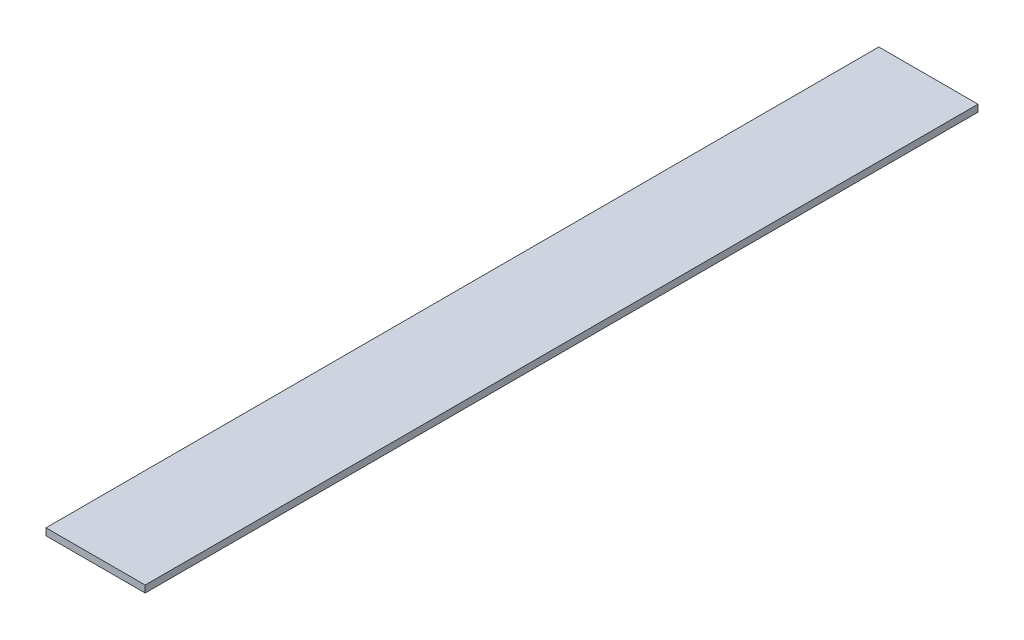
ISO-10303-21;
HEADER;
FILE_DESCRIPTION(('STEP AP214'),'2;1');
FILE_NAME('part.step','',(''),(''),'','','');
FILE_SCHEMA(('AUTOMOTIVE_DESIGN { 1 0 10303 214 1 1 1 1 }'));
ENDSEC;
DATA;
#1=APPLICATION_CONTEXT('core data for automotive mechanical design processes');
#2=APPLICATION_PROTOCOL_DEFINITION('international standard','automotive_design',2000,#1);
#3=PRODUCT_CONTEXT('',#1,'mechanical');
#4=PRODUCT('Part','Part','',(#3));
#5=PRODUCT_RELATED_PRODUCT_CATEGORY('part','',(#4));
#6=PRODUCT_DEFINITION_FORMATION('','',#4);
#7=PRODUCT_DEFINITION_CONTEXT('part definition',#1,'design');
#8=PRODUCT_DEFINITION('design','',#6,#7);
#9=PRODUCT_DEFINITION_SHAPE('','',#8);
#10=(LENGTH_UNIT() NAMED_UNIT(*) SI_UNIT(.MILLI.,.METRE.));
#11=(NAMED_UNIT(*) PLANE_ANGLE_UNIT() SI_UNIT($,.RADIAN.));
#12=(NAMED_UNIT(*) SI_UNIT($,.STERADIAN.) SOLID_ANGLE_UNIT());
#13=UNCERTAINTY_MEASURE_WITH_UNIT(LENGTH_MEASURE(1.E-05),#10,'distance_accuracy_value','');
#14=(GEOMETRIC_REPRESENTATION_CONTEXT(3) GLOBAL_UNCERTAINTY_ASSIGNED_CONTEXT((#13)) GLOBAL_UNIT_ASSIGNED_CONTEXT((#10,
#11,#12)) REPRESENTATION_CONTEXT('',''));
#15=CARTESIAN_POINT('',(0.,0.,0.));
#16=DIRECTION('',(0.,0.,1.));
#17=DIRECTION('',(1.,0.,0.));
#18=AXIS2_PLACEMENT_3D('',#15,#16,#17);
#19=CARTESIAN_POINT('',(-31.0996570422763,7.,840.));
#20=DIRECTION('',(1.,0.,0.));
#21=DIRECTION('',(0.,1.,0.));
#22=AXIS2_PLACEMENT_3D('',#19,#20,#21);
#23=PLANE('',#22);
#24=DIRECTION('',(0.,-1.,0.));
#25=VECTOR('',#24,1.);
#26=CARTESIAN_POINT('',(-31.0996570422763,7.,0.));
#27=LINE('',#26,#25);
#28=CARTESIAN_POINT('',(-31.0996570422763,7.,0.));
#29=VERTEX_POINT('',#28);
#30=CARTESIAN_POINT('',(-31.0996570422764,0.,0.));
#31=VERTEX_POINT('',#30);
#32=EDGE_CURVE('E107',#29,#31,#27,.T.);
#33=ORIENTED_EDGE('',*,*,#32,.T.);
#34=DIRECTION('',(0.,0.,-1.));
#35=VECTOR('',#34,1.);
#36=CARTESIAN_POINT('',(-31.0996570422764,0.,840.));
#37=LINE('',#36,#35);
#38=CARTESIAN_POINT('',(-31.0996570422764,0.,840.));
#39=VERTEX_POINT('',#38);
#40=EDGE_CURVE('E11',#39,#31,#37,.T.);
#41=ORIENTED_EDGE('',*,*,#40,.F.);
#42=DIRECTION('',(0.,-1.,0.));
#43=VECTOR('',#42,1.);
#44=CARTESIAN_POINT('',(-31.0996570422763,7.,840.));
#45=LINE('',#44,#43);
#46=CARTESIAN_POINT('',(-31.0996570422763,7.,840.));
#47=VERTEX_POINT('',#46);
#48=EDGE_CURVE('E91',#47,#39,#45,.T.);
#49=ORIENTED_EDGE('',*,*,#48,.F.);
#50=DIRECTION('',(0.,0.,-1.));
#51=VECTOR('',#50,1.);
#52=CARTESIAN_POINT('',(-31.0996570422763,7.,840.));
#53=LINE('',#52,#51);
#54=EDGE_CURVE('E103',#47,#29,#53,.T.);
#55=ORIENTED_EDGE('',*,*,#54,.T.);
#56=EDGE_LOOP('',(#33,#41,#49,#55));
#57=FACE_BOUND('',#56,.T.);
#58=ADVANCED_FACE('F39',(#57),#23,.F.);
#59=CARTESIAN_POINT('',(-31.0996570422764,0.,840.));
#60=DIRECTION('',(0.,1.,0.));
#61=DIRECTION('',(0.,0.,1.));
#62=AXIS2_PLACEMENT_3D('',#59,#60,#61);
#63=PLANE('',#62);
#64=DIRECTION('',(1.,0.,0.));
#65=VECTOR('',#64,1.);
#66=CARTESIAN_POINT('',(-31.0996570422764,0.,0.));
#67=LINE('',#66,#65);
#68=CARTESIAN_POINT('',(68.9003429577237,0.,0.));
#69=VERTEX_POINT('',#68);
#70=EDGE_CURVE('E96',#31,#69,#67,.T.);
#71=ORIENTED_EDGE('',*,*,#70,.T.);
#72=DIRECTION('',(0.,0.,-1.));
#73=VECTOR('',#72,1.);
#74=CARTESIAN_POINT('',(68.9003429577237,0.,840.));
#75=LINE('',#74,#73);
#76=CARTESIAN_POINT('',(68.9003429577237,0.,840.));
#77=VERTEX_POINT('',#76);
#78=EDGE_CURVE('E48',#77,#69,#75,.T.);
#79=ORIENTED_EDGE('',*,*,#78,.F.);
#80=DIRECTION('',(1.,0.,0.));
#81=VECTOR('',#80,1.);
#82=CARTESIAN_POINT('',(-31.0996570422764,0.,840.));
#83=LINE('',#82,#81);
#84=EDGE_CURVE('E86',#39,#77,#83,.T.);
#85=ORIENTED_EDGE('',*,*,#84,.F.);
#86=ORIENTED_EDGE('',*,*,#40,.T.);
#87=EDGE_LOOP('',(#71,#79,#85,#86));
#88=FACE_BOUND('',#87,.T.);
#89=ADVANCED_FACE('F95',(#88),#63,.F.);
#90=CARTESIAN_POINT('',(68.9003429577237,0.,840.));
#91=DIRECTION('',(-1.,0.,0.));
#92=DIRECTION('',(0.,0.,1.));
#93=AXIS2_PLACEMENT_3D('',#90,#91,#92);
#94=PLANE('',#93);
#95=DIRECTION('',(0.,1.,0.));
#96=VECTOR('',#95,1.);
#97=CARTESIAN_POINT('',(68.9003429577237,0.,0.));
#98=LINE('',#97,#96);
#99=CARTESIAN_POINT('',(68.9003429577237,7.,0.));
#100=VERTEX_POINT('',#99);
#101=EDGE_CURVE('E73',#69,#100,#98,.T.);
#102=ORIENTED_EDGE('',*,*,#101,.T.);
#103=DIRECTION('',(0.,0.,-1.));
#104=VECTOR('',#103,1.);
#105=CARTESIAN_POINT('',(68.9003429577237,7.,840.));
#106=LINE('',#105,#104);
#107=CARTESIAN_POINT('',(68.9003429577237,7.,840.));
#108=VERTEX_POINT('',#107);
#109=EDGE_CURVE('E98',#108,#100,#106,.T.);
#110=ORIENTED_EDGE('',*,*,#109,.F.);
#111=DIRECTION('',(0.,1.,0.));
#112=VECTOR('',#111,1.);
#113=CARTESIAN_POINT('',(68.9003429577237,0.,840.));
#114=LINE('',#113,#112);
#115=EDGE_CURVE('E89',#77,#108,#114,.T.);
#116=ORIENTED_EDGE('',*,*,#115,.F.);
#117=ORIENTED_EDGE('',*,*,#78,.T.);
#118=EDGE_LOOP('',(#102,#110,#116,#117));
#119=FACE_BOUND('',#118,.T.);
#120=ADVANCED_FACE('F99',(#119),#94,.F.);
#121=CARTESIAN_POINT('',(-31.0996570422763,7.,840.));
#122=DIRECTION('',(0.,-1.,0.));
#123=DIRECTION('',(0.,0.,-1.));
#124=AXIS2_PLACEMENT_3D('',#121,#122,#123);
#125=PLANE('',#124);
#126=DIRECTION('',(-1.,0.,0.));
#127=VECTOR('',#126,1.);
#128=CARTESIAN_POINT('',(-31.0996570422763,7.,0.));
#129=LINE('',#128,#127);
#130=EDGE_CURVE('E79',#100,#29,#129,.T.);
#131=ORIENTED_EDGE('',*,*,#130,.T.);
#132=ORIENTED_EDGE('',*,*,#54,.F.);
#133=DIRECTION('',(-1.,0.,0.));
#134=VECTOR('',#133,1.);
#135=CARTESIAN_POINT('',(-31.0996570422763,7.,840.));
#136=LINE('',#135,#134);
#137=EDGE_CURVE('E56',#108,#47,#136,.T.);
#138=ORIENTED_EDGE('',*,*,#137,.F.);
#139=ORIENTED_EDGE('',*,*,#109,.T.);
#140=EDGE_LOOP('',(#131,#132,#138,#139));
#141=FACE_BOUND('',#140,.T.);
#142=ADVANCED_FACE('F120',(#141),#125,.F.);
#143=CARTESIAN_POINT('',(0.,0.,840.));
#144=DIRECTION('',(0.,0.,1.));
#145=DIRECTION('',(1.,0.,0.));
#146=AXIS2_PLACEMENT_3D('',#143,#144,#145);
#147=PLANE('',#146);
#148=ORIENTED_EDGE('',*,*,#48,.T.);
#149=ORIENTED_EDGE('',*,*,#84,.T.);
#150=ORIENTED_EDGE('',*,*,#115,.T.);
#151=ORIENTED_EDGE('',*,*,#137,.T.);
#152=EDGE_LOOP('',(#148,#149,#150,#151));
#153=FACE_BOUND('',#152,.T.);
#154=ADVANCED_FACE('F87',(#153),#147,.T.);
#155=CARTESIAN_POINT('',(0.,0.,0.));
#156=DIRECTION('',(0.,0.,1.));
#157=DIRECTION('',(1.,0.,0.));
#158=AXIS2_PLACEMENT_3D('',#155,#156,#157);
#159=PLANE('',#158);
#160=ORIENTED_EDGE('',*,*,#32,.F.);
#161=ORIENTED_EDGE('',*,*,#130,.F.);
#162=ORIENTED_EDGE('',*,*,#101,.F.);
#163=ORIENTED_EDGE('',*,*,#70,.F.);
#164=EDGE_LOOP('',(#160,#161,#162,#163));
#165=FACE_BOUND('',#164,.T.);
#166=ADVANCED_FACE('F123',(#165),#159,.F.);
#167=CLOSED_SHELL('',(#58,#89,#120,#142,#154,#166));
#168=MANIFOLD_SOLID_BREP('B2',#167);
#169=ADVANCED_BREP_SHAPE_REPRESENTATION('',(#18,#168),#14);
#170=SHAPE_DEFINITION_REPRESENTATION(#9,#169);
ENDSEC;
END-ISO-10303-21;
